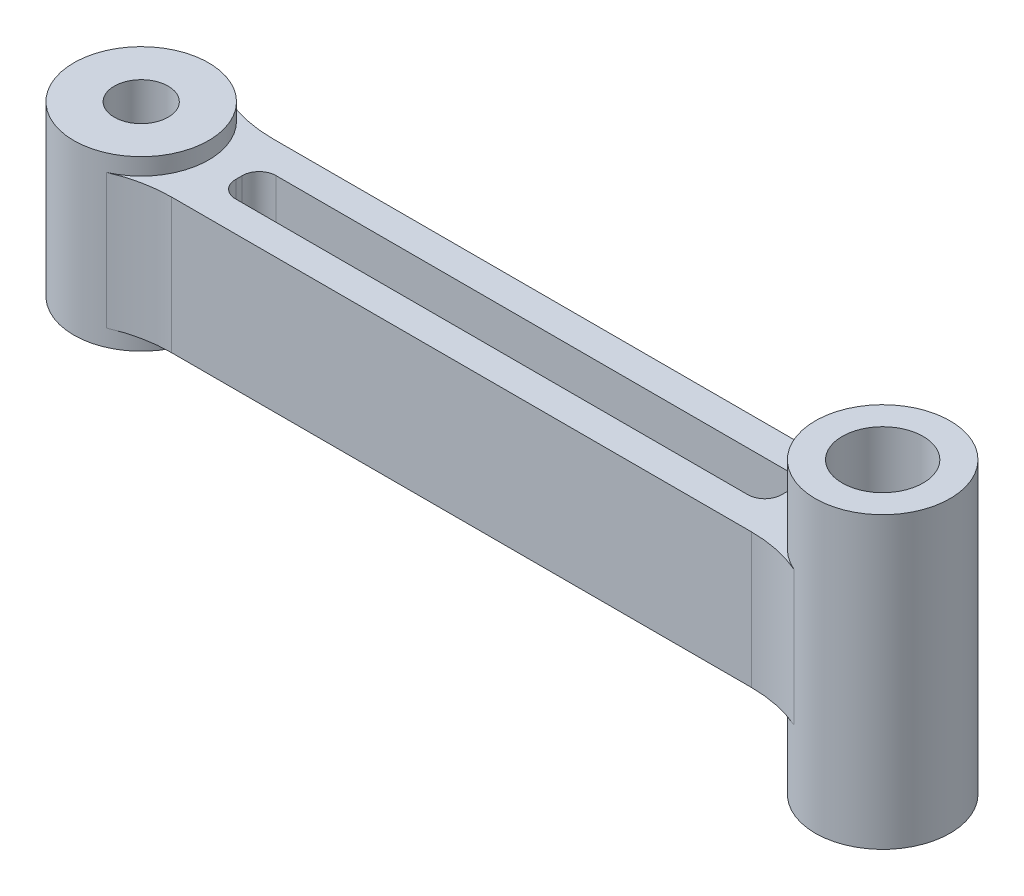
ISO-10303-21;
HEADER;
FILE_DESCRIPTION(('STEP AP214'),'2;1');
FILE_NAME('part.step','',(''),(''),'','','');
FILE_SCHEMA(('AUTOMOTIVE_DESIGN { 1 0 10303 214 1 1 1 1 }'));
ENDSEC;
DATA;
#1=APPLICATION_CONTEXT('core data for automotive mechanical design processes');
#2=APPLICATION_PROTOCOL_DEFINITION('international standard','automotive_design',2000,#1);
#3=PRODUCT_CONTEXT('',#1,'mechanical');
#4=PRODUCT('Part','Part','',(#3));
#5=PRODUCT_RELATED_PRODUCT_CATEGORY('part','',(#4));
#6=PRODUCT_DEFINITION_FORMATION('','',#4);
#7=PRODUCT_DEFINITION_CONTEXT('part definition',#1,'design');
#8=PRODUCT_DEFINITION('design','',#6,#7);
#9=PRODUCT_DEFINITION_SHAPE('','',#8);
#10=(LENGTH_UNIT() NAMED_UNIT(*) SI_UNIT(.MILLI.,.METRE.));
#11=(NAMED_UNIT(*) PLANE_ANGLE_UNIT() SI_UNIT($,.RADIAN.));
#12=(NAMED_UNIT(*) SI_UNIT($,.STERADIAN.) SOLID_ANGLE_UNIT());
#13=UNCERTAINTY_MEASURE_WITH_UNIT(LENGTH_MEASURE(1.E-05),#10,'distance_accuracy_value','');
#14=(GEOMETRIC_REPRESENTATION_CONTEXT(3) GLOBAL_UNCERTAINTY_ASSIGNED_CONTEXT((#13)) GLOBAL_UNIT_ASSIGNED_CONTEXT((#10,
#11,#12)) REPRESENTATION_CONTEXT('',''));
#15=CARTESIAN_POINT('',(0.,0.,0.));
#16=DIRECTION('',(0.,0.,1.));
#17=DIRECTION('',(1.,0.,0.));
#18=AXIS2_PLACEMENT_3D('',#15,#16,#17);
#19=CARTESIAN_POINT('',(0.,-10.,0.));
#20=DIRECTION('',(0.,1.,0.));
#21=DIRECTION('',(0.,0.,1.));
#22=AXIS2_PLACEMENT_3D('',#19,#20,#21);
#23=PLANE('',#22);
#24=DIRECTION('',(-1.,0.,0.));
#25=VECTOR('',#24,1.);
#26=CARTESIAN_POINT('',(0.,-10.,-15.));
#27=LINE('',#26,#25);
#28=CARTESIAN_POINT('',(43.0104211917182,-10.,-15.));
#29=VERTEX_POINT('',#28);
#30=CARTESIAN_POINT('',(-43.0104211917182,-10.,-15.));
#31=VERTEX_POINT('',#30);
#32=EDGE_CURVE('E216',#29,#31,#27,.T.);
#33=ORIENTED_EDGE('',*,*,#32,.F.);
#34=CARTESIAN_POINT('',(43.0104211917182,-10.,-35.));
#35=DIRECTION('',(0.,1.,0.));
#36=DIRECTION('',(0.,0.,1.));
#37=AXIS2_PLACEMENT_3D('',#34,#35,#36);
#38=CIRCLE('',#37,20.);
#39=CARTESIAN_POINT('',(51.0034737305728,-10.,-16.6666666666667));
#40=VERTEX_POINT('',#39);
#41=EDGE_CURVE('E200',#29,#40,#38,.T.);
#42=ORIENTED_EDGE('',*,*,#41,.T.);
#43=CARTESIAN_POINT('',(55.,-10.,-7.49999999999999));
#44=DIRECTION('',(0.,-1.,0.));
#45=DIRECTION('',(0.,0.,1.));
#46=AXIS2_PLACEMENT_3D('',#43,#44,#45);
#47=CIRCLE('',#46,9.99999999999999);
#48=CARTESIAN_POINT('',(51.0034737305727,-10.,1.66666666666667));
#49=VERTEX_POINT('',#48);
#50=EDGE_CURVE('E458',#49,#40,#47,.T.);
#51=ORIENTED_EDGE('',*,*,#50,.F.);
#52=CARTESIAN_POINT('',(43.0104211917182,-10.,20.));
#53=DIRECTION('',(0.,1.,0.));
#54=DIRECTION('',(0.,0.,1.));
#55=AXIS2_PLACEMENT_3D('',#52,#53,#54);
#56=CIRCLE('',#55,20.);
#57=CARTESIAN_POINT('',(43.0104211917182,-10.,0.));
#58=VERTEX_POINT('',#57);
#59=EDGE_CURVE('E256',#49,#58,#56,.T.);
#60=ORIENTED_EDGE('',*,*,#59,.T.);
#61=DIRECTION('',(-1.,0.,0.));
#62=VECTOR('',#61,1.);
#63=CARTESIAN_POINT('',(0.,-10.,0.));
#64=LINE('',#63,#62);
#65=CARTESIAN_POINT('',(-43.0104211917182,-10.,0.));
#66=VERTEX_POINT('',#65);
#67=EDGE_CURVE('E229',#58,#66,#64,.T.);
#68=ORIENTED_EDGE('',*,*,#67,.T.);
#69=CARTESIAN_POINT('',(-43.0104211917182,-10.,20.));
#70=DIRECTION('',(0.,1.,0.));
#71=DIRECTION('',(0.,0.,1.));
#72=AXIS2_PLACEMENT_3D('',#69,#70,#71);
#73=CIRCLE('',#72,20.);
#74=CARTESIAN_POINT('',(-51.0034737305727,-10.,1.66666666666667));
#75=VERTEX_POINT('',#74);
#76=EDGE_CURVE('E265',#66,#75,#73,.T.);
#77=ORIENTED_EDGE('',*,*,#76,.T.);
#78=CARTESIAN_POINT('',(-55.,-10.,-7.49999999999999));
#79=DIRECTION('',(0.,1.,0.));
#80=DIRECTION('',(0.,0.,1.));
#81=AXIS2_PLACEMENT_3D('',#78,#79,#80);
#82=CIRCLE('',#81,9.99999999999999);
#83=CARTESIAN_POINT('',(-51.0034737305727,-10.,-16.6666666666667));
#84=VERTEX_POINT('',#83);
#85=EDGE_CURVE('E226',#75,#84,#82,.T.);
#86=ORIENTED_EDGE('',*,*,#85,.T.);
#87=CARTESIAN_POINT('',(-43.0104211917182,-10.,-35.));
#88=DIRECTION('',(0.,1.,0.));
#89=DIRECTION('',(0.,0.,1.));
#90=AXIS2_PLACEMENT_3D('',#87,#88,#89);
#91=CIRCLE('',#90,20.);
#92=EDGE_CURVE('E225',#84,#31,#91,.T.);
#93=ORIENTED_EDGE('',*,*,#92,.T.);
#94=EDGE_LOOP('',(#33,#42,#51,#60,#68,#77,#86,#93));
#95=FACE_BOUND('',#94,.T.);
#96=DIRECTION('',(-1.,0.,0.));
#97=VECTOR('',#96,1.);
#98=CARTESIAN_POINT('',(40.8137390408889,-10.,-10.5));
#99=LINE('',#98,#97);
#100=CARTESIAN_POINT('',(38.0073545320336,-10.,-10.5));
#101=VERTEX_POINT('',#100);
#102=CARTESIAN_POINT('',(-38.0073545320336,-10.,-10.5));
#103=VERTEX_POINT('',#102);
#104=EDGE_CURVE('E598',#101,#103,#99,.T.);
#105=ORIENTED_EDGE('',*,*,#104,.T.);
#106=CARTESIAN_POINT('',(-38.0073545320336,-10.,-8.));
#107=DIRECTION('',(0.,1.,0.));
#108=DIRECTION('',(0.,0.,1.));
#109=AXIS2_PLACEMENT_3D('',#106,#107,#108);
#110=CIRCLE('',#109,2.5);
#111=CARTESIAN_POINT('',(-40.5062729832051,-10.,-7.92647058823529));
#112=VERTEX_POINT('',#111);
#113=EDGE_CURVE('E327',#103,#112,#110,.T.);
#114=ORIENTED_EDGE('',*,*,#113,.T.);
#115=CARTESIAN_POINT('',(-55.,-10.,-7.49999999999999));
#116=DIRECTION('',(0.,-1.,0.));
#117=DIRECTION('',(0.,0.,1.));
#118=AXIS2_PLACEMENT_3D('',#115,#116,#117);
#119=CIRCLE('',#118,14.5);
#120=CARTESIAN_POINT('',(-40.5062729832051,-10.,-7.0735294117647));
#121=VERTEX_POINT('',#120);
#122=EDGE_CURVE('E592',#112,#121,#119,.T.);
#123=ORIENTED_EDGE('',*,*,#122,.T.);
#124=CARTESIAN_POINT('',(-38.0073545320336,-10.,-6.99999999999999));
#125=DIRECTION('',(0.,1.,0.));
#126=DIRECTION('',(0.,0.,1.));
#127=AXIS2_PLACEMENT_3D('',#124,#125,#126);
#128=CIRCLE('',#127,2.5);
#129=CARTESIAN_POINT('',(-38.0073545320336,-10.,-4.49999999999999));
#130=VERTEX_POINT('',#129);
#131=EDGE_CURVE('E325',#121,#130,#128,.T.);
#132=ORIENTED_EDGE('',*,*,#131,.T.);
#133=DIRECTION('',(1.,0.,0.));
#134=VECTOR('',#133,1.);
#135=CARTESIAN_POINT('',(40.8137390408889,-10.,-4.49999999999999));
#136=LINE('',#135,#134);
#137=CARTESIAN_POINT('',(38.0073545320336,-10.,-4.49999999999999));
#138=VERTEX_POINT('',#137);
#139=EDGE_CURVE('E453',#130,#138,#136,.T.);
#140=ORIENTED_EDGE('',*,*,#139,.T.);
#141=CARTESIAN_POINT('',(38.0073545320336,-10.,-6.99999999999999));
#142=DIRECTION('',(0.,1.,0.));
#143=DIRECTION('',(0.,0.,1.));
#144=AXIS2_PLACEMENT_3D('',#141,#142,#143);
#145=CIRCLE('',#144,2.5);
#146=CARTESIAN_POINT('',(40.5062729832051,-10.,-7.0735294117647));
#147=VERTEX_POINT('',#146);
#148=EDGE_CURVE('E329',#138,#147,#145,.T.);
#149=ORIENTED_EDGE('',*,*,#148,.T.);
#150=CARTESIAN_POINT('',(55.,-10.,-7.49999999999999));
#151=DIRECTION('',(0.,-1.,0.));
#152=DIRECTION('',(0.,0.,1.));
#153=AXIS2_PLACEMENT_3D('',#150,#151,#152);
#154=CIRCLE('',#153,14.5);
#155=CARTESIAN_POINT('',(40.5062729832051,-10.,-7.92647058823529));
#156=VERTEX_POINT('',#155);
#157=EDGE_CURVE('E600',#147,#156,#154,.T.);
#158=ORIENTED_EDGE('',*,*,#157,.T.);
#159=CARTESIAN_POINT('',(38.0073545320336,-10.,-7.99999999999999));
#160=DIRECTION('',(0.,1.,0.));
#161=DIRECTION('',(0.,0.,1.));
#162=AXIS2_PLACEMENT_3D('',#159,#160,#161);
#163=CIRCLE('',#162,2.5);
#164=EDGE_CURVE('E331',#156,#101,#163,.T.);
#165=ORIENTED_EDGE('',*,*,#164,.T.);
#166=EDGE_LOOP('',(#105,#114,#123,#132,#140,#149,#158,#165));
#167=FACE_BOUND('',#166,.T.);
#168=ADVANCED_FACE('F37',(#95,#167),#23,.F.);
#169=CARTESIAN_POINT('',(-55.,21.5,-7.49999999999999));
#170=DIRECTION('',(0.,-1.,0.));
#171=DIRECTION('',(0.,0.,-1.));
#172=AXIS2_PLACEMENT_3D('',#169,#170,#171);
#173=CYLINDRICAL_SURFACE('',#172,4.00000000000001);
#174=CARTESIAN_POINT('',(-55.,12.5,-7.49999999999999));
#175=DIRECTION('',(0.,1.,0.));
#176=DIRECTION('',(0.,0.,1.));
#177=AXIS2_PLACEMENT_3D('',#174,#175,#176);
#178=CIRCLE('',#177,4.00000000000001);
#179=CARTESIAN_POINT('',(-55.,12.5,-3.49999999999998));
#180=VERTEX_POINT('',#179);
#181=EDGE_CURVE('E340',#180,#180,#178,.T.);
#182=ORIENTED_EDGE('',*,*,#181,.T.);
#183=EDGE_LOOP('',(#182));
#184=FACE_BOUND('',#183,.T.);
#185=CARTESIAN_POINT('',(-55.,-12.5,-7.49999999999999));
#186=DIRECTION('',(0.,1.,0.));
#187=DIRECTION('',(0.,0.,1.));
#188=AXIS2_PLACEMENT_3D('',#185,#186,#187);
#189=CIRCLE('',#188,4.00000000000001);
#190=CARTESIAN_POINT('',(-55.,-12.5,-3.49999999999998));
#191=VERTEX_POINT('',#190);
#192=EDGE_CURVE('E41',#191,#191,#189,.T.);
#193=ORIENTED_EDGE('',*,*,#192,.F.);
#194=EDGE_LOOP('',(#193));
#195=FACE_BOUND('',#194,.T.);
#196=ADVANCED_FACE('F39',(#184,#195),#173,.F.);
#197=CARTESIAN_POINT('',(-55.,21.5,-7.49999999999999));
#198=DIRECTION('',(0.,-1.,0.));
#199=DIRECTION('',(0.,0.,-1.));
#200=AXIS2_PLACEMENT_3D('',#197,#198,#199);
#201=CYLINDRICAL_SURFACE('',#200,9.99999999999999);
#202=DIRECTION('',(0.,-1.,0.));
#203=VECTOR('',#202,1.);
#204=CARTESIAN_POINT('',(-51.0034737305727,21.5,-16.6666666666667));
#205=LINE('',#204,#203);
#206=CARTESIAN_POINT('',(-51.0034737305727,10.,-16.6666666666667));
#207=VERTEX_POINT('',#206);
#208=EDGE_CURVE('E210',#207,#84,#205,.T.);
#209=ORIENTED_EDGE('',*,*,#208,.T.);
#210=ORIENTED_EDGE('',*,*,#85,.F.);
#211=DIRECTION('',(0.,-1.,0.));
#212=VECTOR('',#211,1.);
#213=CARTESIAN_POINT('',(-51.0034737305727,21.5,1.66666666666667));
#214=LINE('',#213,#212);
#215=CARTESIAN_POINT('',(-51.0034737305727,10.,1.66666666666667));
#216=VERTEX_POINT('',#215);
#217=EDGE_CURVE('E250',#75,#216,#214,.F.);
#218=ORIENTED_EDGE('',*,*,#217,.T.);
#219=CARTESIAN_POINT('',(-55.,10.,-7.49999999999999));
#220=DIRECTION('',(0.,1.,0.));
#221=DIRECTION('',(0.,0.,1.));
#222=AXIS2_PLACEMENT_3D('',#219,#220,#221);
#223=CIRCLE('',#222,9.99999999999999);
#224=EDGE_CURVE('E478',#216,#207,#223,.T.);
#225=ORIENTED_EDGE('',*,*,#224,.T.);
#226=EDGE_LOOP('',(#209,#210,#218,#225));
#227=FACE_BOUND('',#226,.T.);
#228=CARTESIAN_POINT('',(-55.,12.5,-7.49999999999999));
#229=DIRECTION('',(0.,1.,0.));
#230=DIRECTION('',(0.,0.,1.));
#231=AXIS2_PLACEMENT_3D('',#228,#229,#230);
#232=CIRCLE('',#231,9.99999999999999);
#233=CARTESIAN_POINT('',(-55.,12.5,2.5));
#234=VERTEX_POINT('',#233);
#235=EDGE_CURVE('E240',#234,#234,#232,.T.);
#236=ORIENTED_EDGE('',*,*,#235,.F.);
#237=EDGE_LOOP('',(#236));
#238=FACE_BOUND('',#237,.T.);
#239=CARTESIAN_POINT('',(-55.,-12.5,-7.49999999999999));
#240=DIRECTION('',(0.,1.,0.));
#241=DIRECTION('',(0.,0.,1.));
#242=AXIS2_PLACEMENT_3D('',#239,#240,#241);
#243=CIRCLE('',#242,9.99999999999999);
#244=CARTESIAN_POINT('',(-55.,-12.5,2.5));
#245=VERTEX_POINT('',#244);
#246=EDGE_CURVE('E341',#245,#245,#243,.T.);
#247=ORIENTED_EDGE('',*,*,#246,.T.);
#248=EDGE_LOOP('',(#247));
#249=FACE_BOUND('',#248,.T.);
#250=ADVANCED_FACE('F352',(#227,#238,#249),#201,.T.);
#251=CARTESIAN_POINT('',(0.,12.5,0.));
#252=DIRECTION('',(0.,1.,0.));
#253=DIRECTION('',(0.,0.,1.));
#254=AXIS2_PLACEMENT_3D('',#251,#252,#253);
#255=PLANE('',#254);
#256=ORIENTED_EDGE('',*,*,#181,.F.);
#257=EDGE_LOOP('',(#256));
#258=FACE_BOUND('',#257,.T.);
#259=ORIENTED_EDGE('',*,*,#235,.T.);
#260=EDGE_LOOP('',(#259));
#261=FACE_BOUND('',#260,.T.);
#262=ADVANCED_FACE('F348',(#258,#261),#255,.T.);
#263=CARTESIAN_POINT('',(0.,-12.5,0.));
#264=DIRECTION('',(0.,1.,0.));
#265=DIRECTION('',(0.,0.,1.));
#266=AXIS2_PLACEMENT_3D('',#263,#264,#265);
#267=PLANE('',#266);
#268=ORIENTED_EDGE('',*,*,#192,.T.);
#269=EDGE_LOOP('',(#268));
#270=FACE_BOUND('',#269,.T.);
#271=ORIENTED_EDGE('',*,*,#246,.F.);
#272=EDGE_LOOP('',(#271));
#273=FACE_BOUND('',#272,.T.);
#274=ADVANCED_FACE('F351',(#270,#273),#267,.F.);
#275=CARTESIAN_POINT('',(0.,10.,-15.));
#276=DIRECTION('',(0.,0.,1.));
#277=DIRECTION('',(1.,0.,0.));
#278=AXIS2_PLACEMENT_3D('',#275,#276,#277);
#279=PLANE('',#278);
#280=DIRECTION('',(-1.,0.,0.));
#281=VECTOR('',#280,1.);
#282=CARTESIAN_POINT('',(0.,10.,-15.));
#283=LINE('',#282,#281);
#284=CARTESIAN_POINT('',(43.0104211917182,10.,-15.));
#285=VERTEX_POINT('',#284);
#286=CARTESIAN_POINT('',(-43.0104211917182,10.,-15.));
#287=VERTEX_POINT('',#286);
#288=EDGE_CURVE('E219',#285,#287,#283,.T.);
#289=ORIENTED_EDGE('',*,*,#288,.F.);
#290=DIRECTION('',(0.,1.,0.));
#291=VECTOR('',#290,1.);
#292=CARTESIAN_POINT('',(43.0104211917182,-10.,-15.));
#293=LINE('',#292,#291);
#294=EDGE_CURVE('E204',#285,#29,#293,.F.);
#295=ORIENTED_EDGE('',*,*,#294,.T.);
#296=ORIENTED_EDGE('',*,*,#32,.T.);
#297=DIRECTION('',(0.,1.,0.));
#298=VECTOR('',#297,1.);
#299=CARTESIAN_POINT('',(-43.0104211917182,10.,-15.));
#300=LINE('',#299,#298);
#301=EDGE_CURVE('E221',#31,#287,#300,.T.);
#302=ORIENTED_EDGE('',*,*,#301,.T.);
#303=EDGE_LOOP('',(#289,#295,#296,#302));
#304=FACE_BOUND('',#303,.T.);
#305=ADVANCED_FACE('F215',(#304),#279,.F.);
#306=CARTESIAN_POINT('',(0.,10.,0.));
#307=DIRECTION('',(0.,0.,1.));
#308=DIRECTION('',(1.,0.,0.));
#309=AXIS2_PLACEMENT_3D('',#306,#307,#308);
#310=PLANE('',#309);
#311=ORIENTED_EDGE('',*,*,#67,.F.);
#312=DIRECTION('',(0.,-1.,0.));
#313=VECTOR('',#312,1.);
#314=CARTESIAN_POINT('',(43.0104211917182,10.,0.));
#315=LINE('',#314,#313);
#316=CARTESIAN_POINT('',(43.0104211917182,10.,0.));
#317=VERTEX_POINT('',#316);
#318=EDGE_CURVE('E248',#58,#317,#315,.F.);
#319=ORIENTED_EDGE('',*,*,#318,.T.);
#320=DIRECTION('',(-1.,0.,0.));
#321=VECTOR('',#320,1.);
#322=CARTESIAN_POINT('',(0.,10.,0.));
#323=LINE('',#322,#321);
#324=CARTESIAN_POINT('',(-43.0104211917182,10.,0.));
#325=VERTEX_POINT('',#324);
#326=EDGE_CURVE('E235',#317,#325,#323,.T.);
#327=ORIENTED_EDGE('',*,*,#326,.T.);
#328=DIRECTION('',(0.,-1.,0.));
#329=VECTOR('',#328,1.);
#330=CARTESIAN_POINT('',(-43.0104211917182,10.,0.));
#331=LINE('',#330,#329);
#332=EDGE_CURVE('E245',#325,#66,#331,.T.);
#333=ORIENTED_EDGE('',*,*,#332,.T.);
#334=EDGE_LOOP('',(#311,#319,#327,#333));
#335=FACE_BOUND('',#334,.T.);
#336=ADVANCED_FACE('F367',(#335),#310,.T.);
#337=CARTESIAN_POINT('',(0.,10.,0.));
#338=DIRECTION('',(0.,1.,0.));
#339=DIRECTION('',(0.,0.,1.));
#340=AXIS2_PLACEMENT_3D('',#337,#338,#339);
#341=PLANE('',#340);
#342=CARTESIAN_POINT('',(-55.,10.,-7.49999999999999));
#343=DIRECTION('',(0.,-1.,0.));
#344=DIRECTION('',(0.,0.,1.));
#345=AXIS2_PLACEMENT_3D('',#342,#343,#344);
#346=CIRCLE('',#345,14.5);
#347=CARTESIAN_POINT('',(-40.5062729832051,10.,-7.92647058823529));
#348=VERTEX_POINT('',#347);
#349=CARTESIAN_POINT('',(-40.5062729832051,10.,-7.0735294117647));
#350=VERTEX_POINT('',#349);
#351=EDGE_CURVE('E459',#348,#350,#346,.T.);
#352=ORIENTED_EDGE('',*,*,#351,.F.);
#353=CARTESIAN_POINT('',(-38.0073545320336,10.,-8.));
#354=DIRECTION('',(0.,1.,0.));
#355=DIRECTION('',(0.,0.,1.));
#356=AXIS2_PLACEMENT_3D('',#353,#354,#355);
#357=CIRCLE('',#356,2.5);
#358=CARTESIAN_POINT('',(-38.0073545320336,10.,-10.5));
#359=VERTEX_POINT('',#358);
#360=EDGE_CURVE('E12',#348,#359,#357,.F.);
#361=ORIENTED_EDGE('',*,*,#360,.T.);
#362=DIRECTION('',(-1.,0.,0.));
#363=VECTOR('',#362,1.);
#364=CARTESIAN_POINT('',(40.8137390408889,10.,-10.5));
#365=LINE('',#364,#363);
#366=CARTESIAN_POINT('',(38.0073545320336,10.,-10.5));
#367=VERTEX_POINT('',#366);
#368=EDGE_CURVE('E444',#367,#359,#365,.T.);
#369=ORIENTED_EDGE('',*,*,#368,.F.);
#370=CARTESIAN_POINT('',(38.0073545320336,10.,-7.99999999999999));
#371=DIRECTION('',(0.,1.,0.));
#372=DIRECTION('',(0.,0.,1.));
#373=AXIS2_PLACEMENT_3D('',#370,#371,#372);
#374=CIRCLE('',#373,2.5);
#375=CARTESIAN_POINT('',(40.5062729832051,10.,-7.92647058823529));
#376=VERTEX_POINT('',#375);
#377=EDGE_CURVE('E333',#367,#376,#374,.F.);
#378=ORIENTED_EDGE('',*,*,#377,.T.);
#379=CARTESIAN_POINT('',(55.,10.,-7.49999999999999));
#380=DIRECTION('',(0.,-1.,0.));
#381=DIRECTION('',(0.,0.,1.));
#382=AXIS2_PLACEMENT_3D('',#379,#380,#381);
#383=CIRCLE('',#382,14.5);
#384=CARTESIAN_POINT('',(40.5062729832051,10.,-7.0735294117647));
#385=VERTEX_POINT('',#384);
#386=EDGE_CURVE('E450',#385,#376,#383,.T.);
#387=ORIENTED_EDGE('',*,*,#386,.F.);
#388=CARTESIAN_POINT('',(38.0073545320336,10.,-6.99999999999999));
#389=DIRECTION('',(0.,1.,0.));
#390=DIRECTION('',(0.,0.,1.));
#391=AXIS2_PLACEMENT_3D('',#388,#389,#390);
#392=CIRCLE('',#391,2.5);
#393=CARTESIAN_POINT('',(38.0073545320336,10.,-4.49999999999999));
#394=VERTEX_POINT('',#393);
#395=EDGE_CURVE('E335',#385,#394,#392,.F.);
#396=ORIENTED_EDGE('',*,*,#395,.T.);
#397=DIRECTION('',(1.,0.,0.));
#398=VECTOR('',#397,1.);
#399=CARTESIAN_POINT('',(40.8137390408889,10.,-4.49999999999999));
#400=LINE('',#399,#398);
#401=CARTESIAN_POINT('',(-38.0073545320336,10.,-4.49999999999999));
#402=VERTEX_POINT('',#401);
#403=EDGE_CURVE('E461',#402,#394,#400,.T.);
#404=ORIENTED_EDGE('',*,*,#403,.F.);
#405=CARTESIAN_POINT('',(-38.0073545320336,10.,-6.99999999999999));
#406=DIRECTION('',(0.,1.,0.));
#407=DIRECTION('',(0.,0.,1.));
#408=AXIS2_PLACEMENT_3D('',#405,#406,#407);
#409=CIRCLE('',#408,2.5);
#410=EDGE_CURVE('E46',#402,#350,#409,.F.);
#411=ORIENTED_EDGE('',*,*,#410,.T.);
#412=EDGE_LOOP('',(#352,#361,#369,#378,#387,#396,#404,#411));
#413=FACE_BOUND('',#412,.T.);
#414=ORIENTED_EDGE('',*,*,#326,.F.);
#415=CARTESIAN_POINT('',(43.0104211917182,10.,20.));
#416=DIRECTION('',(0.,1.,0.));
#417=DIRECTION('',(0.,0.,1.));
#418=AXIS2_PLACEMENT_3D('',#415,#416,#417);
#419=CIRCLE('',#418,20.);
#420=CARTESIAN_POINT('',(51.0034737305727,10.,1.66666666666667));
#421=VERTEX_POINT('',#420);
#422=EDGE_CURVE('E258',#317,#421,#419,.F.);
#423=ORIENTED_EDGE('',*,*,#422,.T.);
#424=CARTESIAN_POINT('',(55.,10.,-7.49999999999999));
#425=DIRECTION('',(0.,-1.,0.));
#426=DIRECTION('',(0.,0.,1.));
#427=AXIS2_PLACEMENT_3D('',#424,#425,#426);
#428=CIRCLE('',#427,9.99999999999999);
#429=CARTESIAN_POINT('',(51.0034737305728,10.,-16.6666666666667));
#430=VERTEX_POINT('',#429);
#431=EDGE_CURVE('E467',#421,#430,#428,.T.);
#432=ORIENTED_EDGE('',*,*,#431,.T.);
#433=CARTESIAN_POINT('',(43.0104211917182,10.,-35.));
#434=DIRECTION('',(0.,1.,0.));
#435=DIRECTION('',(0.,0.,1.));
#436=AXIS2_PLACEMENT_3D('',#433,#434,#435);
#437=CIRCLE('',#436,20.);
#438=EDGE_CURVE('E209',#430,#285,#437,.F.);
#439=ORIENTED_EDGE('',*,*,#438,.T.);
#440=ORIENTED_EDGE('',*,*,#288,.T.);
#441=CARTESIAN_POINT('',(-43.0104211917182,10.,-35.));
#442=DIRECTION('',(0.,1.,0.));
#443=DIRECTION('',(0.,0.,1.));
#444=AXIS2_PLACEMENT_3D('',#441,#442,#443);
#445=CIRCLE('',#444,20.);
#446=EDGE_CURVE('E262',#287,#207,#445,.F.);
#447=ORIENTED_EDGE('',*,*,#446,.T.);
#448=ORIENTED_EDGE('',*,*,#224,.F.);
#449=CARTESIAN_POINT('',(-43.0104211917182,10.,20.));
#450=DIRECTION('',(0.,1.,0.));
#451=DIRECTION('',(0.,0.,1.));
#452=AXIS2_PLACEMENT_3D('',#449,#450,#451);
#453=CIRCLE('',#452,20.);
#454=EDGE_CURVE('E268',#216,#325,#453,.F.);
#455=ORIENTED_EDGE('',*,*,#454,.T.);
#456=EDGE_LOOP('',(#414,#423,#432,#439,#440,#447,#448,#455));
#457=FACE_BOUND('',#456,.T.);
#458=ADVANCED_FACE('F377',(#413,#457),#341,.T.);
#459=CARTESIAN_POINT('',(55.,21.5,-7.49999999999999));
#460=DIRECTION('',(0.,-1.,0.));
#461=DIRECTION('',(0.,0.,-1.));
#462=AXIS2_PLACEMENT_3D('',#459,#460,#461);
#463=CYLINDRICAL_SURFACE('',#462,6.00000000000001);
#464=CARTESIAN_POINT('',(55.,21.5,-7.49999999999999));
#465=DIRECTION('',(0.,-1.,0.));
#466=DIRECTION('',(0.,0.,1.));
#467=AXIS2_PLACEMENT_3D('',#464,#465,#466);
#468=CIRCLE('',#467,6.00000000000001);
#469=CARTESIAN_POINT('',(55.,21.5,-1.49999999999998));
#470=VERTEX_POINT('',#469);
#471=EDGE_CURVE('E232',#470,#470,#468,.T.);
#472=ORIENTED_EDGE('',*,*,#471,.F.);
#473=EDGE_LOOP('',(#472));
#474=FACE_BOUND('',#473,.T.);
#475=CARTESIAN_POINT('',(55.,-21.5,-7.49999999999999));
#476=DIRECTION('',(0.,-1.,0.));
#477=DIRECTION('',(0.,0.,1.));
#478=AXIS2_PLACEMENT_3D('',#475,#476,#477);
#479=CIRCLE('',#478,6.00000000000001);
#480=CARTESIAN_POINT('',(55.,-21.5,-1.49999999999998));
#481=VERTEX_POINT('',#480);
#482=EDGE_CURVE('E469',#481,#481,#479,.T.);
#483=ORIENTED_EDGE('',*,*,#482,.T.);
#484=EDGE_LOOP('',(#483));
#485=FACE_BOUND('',#484,.T.);
#486=ADVANCED_FACE('F496',(#474,#485),#463,.F.);
#487=CARTESIAN_POINT('',(55.,21.5,-7.49999999999999));
#488=DIRECTION('',(0.,-1.,0.));
#489=DIRECTION('',(0.,0.,-1.));
#490=AXIS2_PLACEMENT_3D('',#487,#488,#489);
#491=CYLINDRICAL_SURFACE('',#490,9.99999999999999);
#492=ORIENTED_EDGE('',*,*,#50,.T.);
#493=DIRECTION('',(0.,-1.,0.));
#494=VECTOR('',#493,1.);
#495=CARTESIAN_POINT('',(51.0034737305728,21.5,-16.6666666666667));
#496=LINE('',#495,#494);
#497=EDGE_CURVE('E206',#40,#430,#496,.F.);
#498=ORIENTED_EDGE('',*,*,#497,.T.);
#499=ORIENTED_EDGE('',*,*,#431,.F.);
#500=DIRECTION('',(0.,-1.,0.));
#501=VECTOR('',#500,1.);
#502=CARTESIAN_POINT('',(51.0034737305727,21.5,1.66666666666667));
#503=LINE('',#502,#501);
#504=EDGE_CURVE('E220',#421,#49,#503,.T.);
#505=ORIENTED_EDGE('',*,*,#504,.T.);
#506=EDGE_LOOP('',(#492,#498,#499,#505));
#507=FACE_BOUND('',#506,.T.);
#508=CARTESIAN_POINT('',(55.,21.5,-7.49999999999999));
#509=DIRECTION('',(0.,-1.,0.));
#510=DIRECTION('',(0.,0.,1.));
#511=AXIS2_PLACEMENT_3D('',#508,#509,#510);
#512=CIRCLE('',#511,9.99999999999999);
#513=CARTESIAN_POINT('',(55.,21.5,2.5));
#514=VERTEX_POINT('',#513);
#515=EDGE_CURVE('E227',#514,#514,#512,.T.);
#516=ORIENTED_EDGE('',*,*,#515,.T.);
#517=EDGE_LOOP('',(#516));
#518=FACE_BOUND('',#517,.T.);
#519=CARTESIAN_POINT('',(55.,-21.5,-7.49999999999999));
#520=DIRECTION('',(0.,-1.,0.));
#521=DIRECTION('',(0.,0.,1.));
#522=AXIS2_PLACEMENT_3D('',#519,#520,#521);
#523=CIRCLE('',#522,9.99999999999999);
#524=CARTESIAN_POINT('',(55.,-21.5,2.5));
#525=VERTEX_POINT('',#524);
#526=EDGE_CURVE('E472',#525,#525,#523,.T.);
#527=ORIENTED_EDGE('',*,*,#526,.F.);
#528=EDGE_LOOP('',(#527));
#529=FACE_BOUND('',#528,.T.);
#530=ADVANCED_FACE('F492',(#507,#518,#529),#491,.T.);
#531=CARTESIAN_POINT('',(0.,21.5,0.));
#532=DIRECTION('',(0.,1.,0.));
#533=DIRECTION('',(0.,0.,1.));
#534=AXIS2_PLACEMENT_3D('',#531,#532,#533);
#535=PLANE('',#534);
#536=ORIENTED_EDGE('',*,*,#471,.T.);
#537=EDGE_LOOP('',(#536));
#538=FACE_BOUND('',#537,.T.);
#539=ORIENTED_EDGE('',*,*,#515,.F.);
#540=EDGE_LOOP('',(#539));
#541=FACE_BOUND('',#540,.T.);
#542=ADVANCED_FACE('F495',(#538,#541),#535,.T.);
#543=CARTESIAN_POINT('',(0.,-21.5,0.));
#544=DIRECTION('',(0.,1.,0.));
#545=DIRECTION('',(0.,0.,1.));
#546=AXIS2_PLACEMENT_3D('',#543,#544,#545);
#547=PLANE('',#546);
#548=ORIENTED_EDGE('',*,*,#482,.F.);
#549=EDGE_LOOP('',(#548));
#550=FACE_BOUND('',#549,.T.);
#551=ORIENTED_EDGE('',*,*,#526,.T.);
#552=EDGE_LOOP('',(#551));
#553=FACE_BOUND('',#552,.T.);
#554=ADVANCED_FACE('F502',(#550,#553),#547,.F.);
#555=CARTESIAN_POINT('',(-55.,3.75,-7.49999999999999));
#556=DIRECTION('',(0.,1.,0.));
#557=DIRECTION('',(0.,0.,1.));
#558=AXIS2_PLACEMENT_3D('',#555,#556,#557);
#559=CYLINDRICAL_SURFACE('',#558,14.5);
#560=ORIENTED_EDGE('',*,*,#351,.T.);
#561=DIRECTION('',(0.,1.,0.));
#562=VECTOR('',#561,1.);
#563=CARTESIAN_POINT('',(-40.5062729832051,3.75,-7.0735294117647));
#564=LINE('',#563,#562);
#565=CARTESIAN_POINT('',(-40.5062729832051,3.75,-7.0735294117647));
#566=VERTEX_POINT('',#565);
#567=EDGE_CURVE('E323',#350,#566,#564,.F.);
#568=ORIENTED_EDGE('',*,*,#567,.T.);
#569=CARTESIAN_POINT('',(-55.,3.75,-7.49999999999999));
#570=DIRECTION('',(0.,-1.,0.));
#571=DIRECTION('',(0.,0.,1.));
#572=AXIS2_PLACEMENT_3D('',#569,#570,#571);
#573=CIRCLE('',#572,14.5);
#574=CARTESIAN_POINT('',(-40.5062729832051,3.75,-7.92647058823529));
#575=VERTEX_POINT('',#574);
#576=EDGE_CURVE('E436',#575,#566,#573,.T.);
#577=ORIENTED_EDGE('',*,*,#576,.F.);
#578=DIRECTION('',(0.,1.,0.));
#579=VECTOR('',#578,1.);
#580=CARTESIAN_POINT('',(-40.5062729832051,3.75,-7.92647058823529));
#581=LINE('',#580,#579);
#582=EDGE_CURVE('E321',#575,#348,#581,.T.);
#583=ORIENTED_EDGE('',*,*,#582,.T.);
#584=EDGE_LOOP('',(#560,#568,#577,#583));
#585=FACE_BOUND('',#584,.T.);
#586=ADVANCED_FACE('F441',(#585),#559,.T.);
#587=CARTESIAN_POINT('',(40.8137390408889,3.75,-10.5));
#588=DIRECTION('',(0.,0.,-1.));
#589=DIRECTION('',(-1.,0.,0.));
#590=AXIS2_PLACEMENT_3D('',#587,#588,#589);
#591=PLANE('',#590);
#592=DIRECTION('',(-1.,0.,0.));
#593=VECTOR('',#592,1.);
#594=CARTESIAN_POINT('',(40.8137390408889,3.75,-10.5));
#595=LINE('',#594,#593);
#596=CARTESIAN_POINT('',(38.0073545320336,3.75,-10.5));
#597=VERTEX_POINT('',#596);
#598=CARTESIAN_POINT('',(-38.0073545320336,3.75,-10.5));
#599=VERTEX_POINT('',#598);
#600=EDGE_CURVE('E439',#597,#599,#595,.T.);
#601=ORIENTED_EDGE('',*,*,#600,.F.);
#602=DIRECTION('',(0.,-1.,0.));
#603=VECTOR('',#602,1.);
#604=CARTESIAN_POINT('',(38.0073545320336,10.,-10.5));
#605=LINE('',#604,#603);
#606=EDGE_CURVE('E300',#597,#367,#605,.F.);
#607=ORIENTED_EDGE('',*,*,#606,.T.);
#608=ORIENTED_EDGE('',*,*,#368,.T.);
#609=DIRECTION('',(0.,-1.,0.));
#610=VECTOR('',#609,1.);
#611=CARTESIAN_POINT('',(-38.0073545320336,3.75,-10.5));
#612=LINE('',#611,#610);
#613=EDGE_CURVE('E298',#359,#599,#612,.T.);
#614=ORIENTED_EDGE('',*,*,#613,.T.);
#615=EDGE_LOOP('',(#601,#607,#608,#614));
#616=FACE_BOUND('',#615,.T.);
#617=ADVANCED_FACE('F510',(#616),#591,.F.);
#618=CARTESIAN_POINT('',(55.,3.75,-7.49999999999999));
#619=DIRECTION('',(0.,1.,0.));
#620=DIRECTION('',(0.,0.,1.));
#621=AXIS2_PLACEMENT_3D('',#618,#619,#620);
#622=CYLINDRICAL_SURFACE('',#621,14.5);
#623=ORIENTED_EDGE('',*,*,#386,.T.);
#624=DIRECTION('',(0.,1.,0.));
#625=VECTOR('',#624,1.);
#626=CARTESIAN_POINT('',(40.5062729832051,3.75,-7.92647058823529));
#627=LINE('',#626,#625);
#628=CARTESIAN_POINT('',(40.5062729832051,3.75,-7.92647058823529));
#629=VERTEX_POINT('',#628);
#630=EDGE_CURVE('E306',#376,#629,#627,.F.);
#631=ORIENTED_EDGE('',*,*,#630,.T.);
#632=CARTESIAN_POINT('',(55.,3.75,-7.49999999999999));
#633=DIRECTION('',(0.,-1.,0.));
#634=DIRECTION('',(0.,0.,1.));
#635=AXIS2_PLACEMENT_3D('',#632,#633,#634);
#636=CIRCLE('',#635,14.5);
#637=CARTESIAN_POINT('',(40.5062729832051,3.75,-7.0735294117647));
#638=VERTEX_POINT('',#637);
#639=EDGE_CURVE('E447',#638,#629,#636,.T.);
#640=ORIENTED_EDGE('',*,*,#639,.F.);
#641=DIRECTION('',(0.,1.,0.));
#642=VECTOR('',#641,1.);
#643=CARTESIAN_POINT('',(40.5062729832051,3.75,-7.0735294117647));
#644=LINE('',#643,#642);
#645=EDGE_CURVE('E303',#638,#385,#644,.T.);
#646=ORIENTED_EDGE('',*,*,#645,.T.);
#647=EDGE_LOOP('',(#623,#631,#640,#646));
#648=FACE_BOUND('',#647,.T.);
#649=ADVANCED_FACE('F536',(#648),#622,.T.);
#650=CARTESIAN_POINT('',(40.8137390408889,3.75,-4.49999999999999));
#651=DIRECTION('',(0.,0.,1.));
#652=DIRECTION('',(1.,0.,0.));
#653=AXIS2_PLACEMENT_3D('',#650,#651,#652);
#654=PLANE('',#653);
#655=ORIENTED_EDGE('',*,*,#403,.T.);
#656=DIRECTION('',(0.,-1.,0.));
#657=VECTOR('',#656,1.);
#658=CARTESIAN_POINT('',(38.0073545320336,3.75,-4.49999999999999));
#659=LINE('',#658,#657);
#660=CARTESIAN_POINT('',(38.0073545320336,3.75,-4.49999999999999));
#661=VERTEX_POINT('',#660);
#662=EDGE_CURVE('E319',#394,#661,#659,.T.);
#663=ORIENTED_EDGE('',*,*,#662,.T.);
#664=DIRECTION('',(1.,0.,0.));
#665=VECTOR('',#664,1.);
#666=CARTESIAN_POINT('',(40.8137390408889,3.75,-4.49999999999999));
#667=LINE('',#666,#665);
#668=CARTESIAN_POINT('',(-38.0073545320336,3.75,-4.49999999999999));
#669=VERTEX_POINT('',#668);
#670=EDGE_CURVE('E443',#669,#661,#667,.T.);
#671=ORIENTED_EDGE('',*,*,#670,.F.);
#672=DIRECTION('',(0.,-1.,0.));
#673=VECTOR('',#672,1.);
#674=CARTESIAN_POINT('',(-38.0073545320336,10.,-4.49999999999999));
#675=LINE('',#674,#673);
#676=EDGE_CURVE('E316',#669,#402,#675,.F.);
#677=ORIENTED_EDGE('',*,*,#676,.T.);
#678=EDGE_LOOP('',(#655,#663,#671,#677));
#679=FACE_BOUND('',#678,.T.);
#680=ADVANCED_FACE('F530',(#679),#654,.F.);
#681=CARTESIAN_POINT('',(-55.,3.75,-7.49999999999999));
#682=DIRECTION('',(0.,1.,0.));
#683=DIRECTION('',(0.,0.,1.));
#684=AXIS2_PLACEMENT_3D('',#681,#682,#683);
#685=PLANE('',#684);
#686=ORIENTED_EDGE('',*,*,#639,.T.);
#687=CARTESIAN_POINT('',(38.0073545320336,3.75,-7.99999999999999));
#688=DIRECTION('',(0.,1.,0.));
#689=DIRECTION('',(0.,0.,1.));
#690=AXIS2_PLACEMENT_3D('',#687,#688,#689);
#691=CIRCLE('',#690,2.5);
#692=EDGE_CURVE('E314',#629,#597,#691,.T.);
#693=ORIENTED_EDGE('',*,*,#692,.T.);
#694=ORIENTED_EDGE('',*,*,#600,.T.);
#695=CARTESIAN_POINT('',(-38.0073545320336,3.75,-8.));
#696=DIRECTION('',(0.,1.,0.));
#697=DIRECTION('',(0.,0.,1.));
#698=AXIS2_PLACEMENT_3D('',#695,#696,#697);
#699=CIRCLE('',#698,2.5);
#700=EDGE_CURVE('E308',#599,#575,#699,.T.);
#701=ORIENTED_EDGE('',*,*,#700,.T.);
#702=ORIENTED_EDGE('',*,*,#576,.T.);
#703=CARTESIAN_POINT('',(-38.0073545320336,3.75,-6.99999999999999));
#704=DIRECTION('',(0.,1.,0.));
#705=DIRECTION('',(0.,0.,1.));
#706=AXIS2_PLACEMENT_3D('',#703,#704,#705);
#707=CIRCLE('',#706,2.5);
#708=EDGE_CURVE('E310',#566,#669,#707,.T.);
#709=ORIENTED_EDGE('',*,*,#708,.T.);
#710=ORIENTED_EDGE('',*,*,#670,.T.);
#711=CARTESIAN_POINT('',(38.0073545320336,3.75,-6.99999999999999));
#712=DIRECTION('',(0.,1.,0.));
#713=DIRECTION('',(0.,0.,1.));
#714=AXIS2_PLACEMENT_3D('',#711,#712,#713);
#715=CIRCLE('',#714,2.5);
#716=EDGE_CURVE('E312',#661,#638,#715,.T.);
#717=ORIENTED_EDGE('',*,*,#716,.T.);
#718=EDGE_LOOP('',(#686,#693,#694,#701,#702,#709,#710,#717));
#719=FACE_BOUND('',#718,.T.);
#720=ADVANCED_FACE('F435',(#719),#685,.T.);
#721=CARTESIAN_POINT('',(-55.,-3.75,-7.49999999999999));
#722=DIRECTION('',(0.,-1.,0.));
#723=DIRECTION('',(0.,0.,-1.));
#724=AXIS2_PLACEMENT_3D('',#721,#722,#723);
#725=CYLINDRICAL_SURFACE('',#724,14.5);
#726=CARTESIAN_POINT('',(-55.,-3.75,-7.49999999999999));
#727=DIRECTION('',(0.,-1.,0.));
#728=DIRECTION('',(0.,0.,1.));
#729=AXIS2_PLACEMENT_3D('',#726,#727,#728);
#730=CIRCLE('',#729,14.5);
#731=CARTESIAN_POINT('',(-40.5062729832051,-3.75,-7.92647058823529));
#732=VERTEX_POINT('',#731);
#733=CARTESIAN_POINT('',(-40.5062729832051,-3.75,-7.0735294117647));
#734=VERTEX_POINT('',#733);
#735=EDGE_CURVE('E594',#732,#734,#730,.T.);
#736=ORIENTED_EDGE('',*,*,#735,.T.);
#737=DIRECTION('',(0.,-1.,0.));
#738=VECTOR('',#737,1.);
#739=CARTESIAN_POINT('',(-40.5062729832051,-3.75,-7.0735294117647));
#740=LINE('',#739,#738);
#741=EDGE_CURVE('E272',#734,#121,#740,.T.);
#742=ORIENTED_EDGE('',*,*,#741,.T.);
#743=ORIENTED_EDGE('',*,*,#122,.F.);
#744=DIRECTION('',(0.,-1.,0.));
#745=VECTOR('',#744,1.);
#746=CARTESIAN_POINT('',(-40.5062729832051,-3.75,-7.92647058823529));
#747=LINE('',#746,#745);
#748=EDGE_CURVE('E270',#112,#732,#747,.F.);
#749=ORIENTED_EDGE('',*,*,#748,.T.);
#750=EDGE_LOOP('',(#736,#742,#743,#749));
#751=FACE_BOUND('',#750,.T.);
#752=ADVANCED_FACE('F554',(#751),#725,.T.);
#753=CARTESIAN_POINT('',(40.8137390408889,-3.75,-4.49999999999999));
#754=DIRECTION('',(0.,0.,-1.));
#755=DIRECTION('',(-1.,0.,0.));
#756=AXIS2_PLACEMENT_3D('',#753,#754,#755);
#757=PLANE('',#756);
#758=ORIENTED_EDGE('',*,*,#139,.F.);
#759=DIRECTION('',(0.,1.,0.));
#760=VECTOR('',#759,1.);
#761=CARTESIAN_POINT('',(-38.0073545320336,-3.75,-4.49999999999999));
#762=LINE('',#761,#760);
#763=CARTESIAN_POINT('',(-38.0073545320336,-3.75,-4.49999999999999));
#764=VERTEX_POINT('',#763);
#765=EDGE_CURVE('E278',#130,#764,#762,.T.);
#766=ORIENTED_EDGE('',*,*,#765,.T.);
#767=DIRECTION('',(1.,0.,0.));
#768=VECTOR('',#767,1.);
#769=CARTESIAN_POINT('',(40.8137390408889,-3.75,-4.49999999999999));
#770=LINE('',#769,#768);
#771=CARTESIAN_POINT('',(38.0073545320336,-3.75,-4.49999999999999));
#772=VERTEX_POINT('',#771);
#773=EDGE_CURVE('E462',#764,#772,#770,.T.);
#774=ORIENTED_EDGE('',*,*,#773,.T.);
#775=DIRECTION('',(0.,1.,0.));
#776=VECTOR('',#775,1.);
#777=CARTESIAN_POINT('',(38.0073545320336,-10.,-4.49999999999999));
#778=LINE('',#777,#776);
#779=EDGE_CURVE('E275',#772,#138,#778,.F.);
#780=ORIENTED_EDGE('',*,*,#779,.T.);
#781=EDGE_LOOP('',(#758,#766,#774,#780));
#782=FACE_BOUND('',#781,.T.);
#783=ADVANCED_FACE('F558',(#782),#757,.T.);
#784=CARTESIAN_POINT('',(55.,-3.75,-7.49999999999999));
#785=DIRECTION('',(0.,-1.,0.));
#786=DIRECTION('',(0.,0.,-1.));
#787=AXIS2_PLACEMENT_3D('',#784,#785,#786);
#788=CYLINDRICAL_SURFACE('',#787,14.5);
#789=ORIENTED_EDGE('',*,*,#157,.F.);
#790=DIRECTION('',(0.,-1.,0.));
#791=VECTOR('',#790,1.);
#792=CARTESIAN_POINT('',(40.5062729832051,-3.75,-7.0735294117647));
#793=LINE('',#792,#791);
#794=CARTESIAN_POINT('',(40.5062729832051,-3.75,-7.0735294117647));
#795=VERTEX_POINT('',#794);
#796=EDGE_CURVE('E296',#147,#795,#793,.F.);
#797=ORIENTED_EDGE('',*,*,#796,.T.);
#798=CARTESIAN_POINT('',(55.,-3.75,-7.49999999999999));
#799=DIRECTION('',(0.,-1.,0.));
#800=DIRECTION('',(0.,0.,1.));
#801=AXIS2_PLACEMENT_3D('',#798,#799,#800);
#802=CIRCLE('',#801,14.5);
#803=CARTESIAN_POINT('',(40.5062729832051,-3.75,-7.92647058823529));
#804=VERTEX_POINT('',#803);
#805=EDGE_CURVE('E586',#795,#804,#802,.T.);
#806=ORIENTED_EDGE('',*,*,#805,.T.);
#807=DIRECTION('',(0.,-1.,0.));
#808=VECTOR('',#807,1.);
#809=CARTESIAN_POINT('',(40.5062729832051,-3.75,-7.92647058823529));
#810=LINE('',#809,#808);
#811=EDGE_CURVE('E293',#804,#156,#810,.T.);
#812=ORIENTED_EDGE('',*,*,#811,.T.);
#813=EDGE_LOOP('',(#789,#797,#806,#812));
#814=FACE_BOUND('',#813,.T.);
#815=ADVANCED_FACE('F563',(#814),#788,.T.);
#816=CARTESIAN_POINT('',(40.8137390408889,-3.75,-10.5));
#817=DIRECTION('',(0.,0.,1.));
#818=DIRECTION('',(1.,0.,0.));
#819=AXIS2_PLACEMENT_3D('',#816,#817,#818);
#820=PLANE('',#819);
#821=DIRECTION('',(-1.,0.,0.));
#822=VECTOR('',#821,1.);
#823=CARTESIAN_POINT('',(40.8137390408889,-3.75,-10.5));
#824=LINE('',#823,#822);
#825=CARTESIAN_POINT('',(38.0073545320336,-3.75,-10.5));
#826=VERTEX_POINT('',#825);
#827=CARTESIAN_POINT('',(-38.0073545320336,-3.75,-10.5));
#828=VERTEX_POINT('',#827);
#829=EDGE_CURVE('E605',#826,#828,#824,.T.);
#830=ORIENTED_EDGE('',*,*,#829,.T.);
#831=DIRECTION('',(0.,1.,0.));
#832=VECTOR('',#831,1.);
#833=CARTESIAN_POINT('',(-38.0073545320336,-10.,-10.5));
#834=LINE('',#833,#832);
#835=EDGE_CURVE('E290',#828,#103,#834,.F.);
#836=ORIENTED_EDGE('',*,*,#835,.T.);
#837=ORIENTED_EDGE('',*,*,#104,.F.);
#838=DIRECTION('',(0.,1.,0.));
#839=VECTOR('',#838,1.);
#840=CARTESIAN_POINT('',(38.0073545320336,-3.75,-10.5));
#841=LINE('',#840,#839);
#842=EDGE_CURVE('E288',#101,#826,#841,.T.);
#843=ORIENTED_EDGE('',*,*,#842,.T.);
#844=EDGE_LOOP('',(#830,#836,#837,#843));
#845=FACE_BOUND('',#844,.T.);
#846=ADVANCED_FACE('F568',(#845),#820,.T.);
#847=CARTESIAN_POINT('',(-55.,-3.75,-7.49999999999999));
#848=DIRECTION('',(0.,-1.,0.));
#849=DIRECTION('',(0.,0.,1.));
#850=AXIS2_PLACEMENT_3D('',#847,#848,#849);
#851=PLANE('',#850);
#852=ORIENTED_EDGE('',*,*,#773,.F.);
#853=CARTESIAN_POINT('',(-38.0073545320336,-3.75,-6.99999999999999));
#854=DIRECTION('',(0.,-1.,0.));
#855=DIRECTION('',(0.,0.,-1.));
#856=AXIS2_PLACEMENT_3D('',#853,#854,#855);
#857=CIRCLE('',#856,2.5);
#858=EDGE_CURVE('E286',#764,#734,#857,.T.);
#859=ORIENTED_EDGE('',*,*,#858,.T.);
#860=ORIENTED_EDGE('',*,*,#735,.F.);
#861=CARTESIAN_POINT('',(-38.0073545320336,-3.75,-8.));
#862=DIRECTION('',(0.,-1.,0.));
#863=DIRECTION('',(0.,0.,-1.));
#864=AXIS2_PLACEMENT_3D('',#861,#862,#863);
#865=CIRCLE('',#864,2.5);
#866=EDGE_CURVE('E284',#732,#828,#865,.T.);
#867=ORIENTED_EDGE('',*,*,#866,.T.);
#868=ORIENTED_EDGE('',*,*,#829,.F.);
#869=CARTESIAN_POINT('',(38.0073545320336,-3.75,-7.99999999999999));
#870=DIRECTION('',(0.,-1.,0.));
#871=DIRECTION('',(0.,0.,-1.));
#872=AXIS2_PLACEMENT_3D('',#869,#870,#871);
#873=CIRCLE('',#872,2.5);
#874=EDGE_CURVE('E280',#826,#804,#873,.T.);
#875=ORIENTED_EDGE('',*,*,#874,.T.);
#876=ORIENTED_EDGE('',*,*,#805,.F.);
#877=CARTESIAN_POINT('',(38.0073545320336,-3.75,-6.99999999999999));
#878=DIRECTION('',(0.,-1.,0.));
#879=DIRECTION('',(0.,0.,-1.));
#880=AXIS2_PLACEMENT_3D('',#877,#878,#879);
#881=CIRCLE('',#880,2.5);
#882=EDGE_CURVE('E282',#795,#772,#881,.T.);
#883=ORIENTED_EDGE('',*,*,#882,.T.);
#884=EDGE_LOOP('',(#852,#859,#860,#867,#868,#875,#876,#883));
#885=FACE_BOUND('',#884,.T.);
#886=ADVANCED_FACE('F385',(#885),#851,.T.);
#887=CARTESIAN_POINT('',(43.0104211917182,21.5,-35.));
#888=DIRECTION('',(0.,-1.,0.));
#889=DIRECTION('',(0.,0.,-1.));
#890=AXIS2_PLACEMENT_3D('',#887,#888,#889);
#891=CYLINDRICAL_SURFACE('',#890,20.);
#892=ORIENTED_EDGE('',*,*,#438,.F.);
#893=ORIENTED_EDGE('',*,*,#497,.F.);
#894=ORIENTED_EDGE('',*,*,#41,.F.);
#895=ORIENTED_EDGE('',*,*,#294,.F.);
#896=EDGE_LOOP('',(#892,#893,#894,#895));
#897=FACE_BOUND('',#896,.T.);
#898=ADVANCED_FACE('F203',(#897),#891,.F.);
#899=CARTESIAN_POINT('',(43.0104211917182,21.5,20.));
#900=DIRECTION('',(0.,-1.,0.));
#901=DIRECTION('',(0.,0.,-1.));
#902=AXIS2_PLACEMENT_3D('',#899,#900,#901);
#903=CYLINDRICAL_SURFACE('',#902,20.);
#904=ORIENTED_EDGE('',*,*,#422,.F.);
#905=ORIENTED_EDGE('',*,*,#318,.F.);
#906=ORIENTED_EDGE('',*,*,#59,.F.);
#907=ORIENTED_EDGE('',*,*,#504,.F.);
#908=EDGE_LOOP('',(#904,#905,#906,#907));
#909=FACE_BOUND('',#908,.T.);
#910=ADVANCED_FACE('F384',(#909),#903,.F.);
#911=CARTESIAN_POINT('',(-43.0104211917182,21.5,-35.));
#912=DIRECTION('',(0.,-1.,0.));
#913=DIRECTION('',(0.,0.,-1.));
#914=AXIS2_PLACEMENT_3D('',#911,#912,#913);
#915=CYLINDRICAL_SURFACE('',#914,20.);
#916=ORIENTED_EDGE('',*,*,#446,.F.);
#917=ORIENTED_EDGE('',*,*,#301,.F.);
#918=ORIENTED_EDGE('',*,*,#92,.F.);
#919=ORIENTED_EDGE('',*,*,#208,.F.);
#920=EDGE_LOOP('',(#916,#917,#918,#919));
#921=FACE_BOUND('',#920,.T.);
#922=ADVANCED_FACE('F388',(#921),#915,.F.);
#923=CARTESIAN_POINT('',(-43.0104211917182,21.5,20.));
#924=DIRECTION('',(0.,-1.,0.));
#925=DIRECTION('',(0.,0.,-1.));
#926=AXIS2_PLACEMENT_3D('',#923,#924,#925);
#927=CYLINDRICAL_SURFACE('',#926,20.);
#928=ORIENTED_EDGE('',*,*,#454,.F.);
#929=ORIENTED_EDGE('',*,*,#217,.F.);
#930=ORIENTED_EDGE('',*,*,#76,.F.);
#931=ORIENTED_EDGE('',*,*,#332,.F.);
#932=EDGE_LOOP('',(#928,#929,#930,#931));
#933=FACE_BOUND('',#932,.T.);
#934=ADVANCED_FACE('F392',(#933),#927,.F.);
#935=CARTESIAN_POINT('',(-38.0073545320336,-3.75,-6.99999999999999));
#936=DIRECTION('',(0.,-1.,0.));
#937=DIRECTION('',(0.,0.,-1.));
#938=AXIS2_PLACEMENT_3D('',#935,#936,#937);
#939=CYLINDRICAL_SURFACE('',#938,2.5);
#940=ORIENTED_EDGE('',*,*,#858,.F.);
#941=ORIENTED_EDGE('',*,*,#765,.F.);
#942=ORIENTED_EDGE('',*,*,#131,.F.);
#943=ORIENTED_EDGE('',*,*,#741,.F.);
#944=EDGE_LOOP('',(#940,#941,#942,#943));
#945=FACE_BOUND('',#944,.T.);
#946=ADVANCED_FACE('F396',(#945),#939,.F.);
#947=CARTESIAN_POINT('',(-38.0073545320336,-3.75,-8.));
#948=DIRECTION('',(0.,-1.,0.));
#949=DIRECTION('',(0.,0.,-1.));
#950=AXIS2_PLACEMENT_3D('',#947,#948,#949);
#951=CYLINDRICAL_SURFACE('',#950,2.5);
#952=ORIENTED_EDGE('',*,*,#866,.F.);
#953=ORIENTED_EDGE('',*,*,#748,.F.);
#954=ORIENTED_EDGE('',*,*,#113,.F.);
#955=ORIENTED_EDGE('',*,*,#835,.F.);
#956=EDGE_LOOP('',(#952,#953,#954,#955));
#957=FACE_BOUND('',#956,.T.);
#958=ADVANCED_FACE('F400',(#957),#951,.F.);
#959=CARTESIAN_POINT('',(38.0073545320336,-3.75,-6.99999999999999));
#960=DIRECTION('',(0.,-1.,0.));
#961=DIRECTION('',(0.,0.,-1.));
#962=AXIS2_PLACEMENT_3D('',#959,#960,#961);
#963=CYLINDRICAL_SURFACE('',#962,2.5);
#964=ORIENTED_EDGE('',*,*,#882,.F.);
#965=ORIENTED_EDGE('',*,*,#796,.F.);
#966=ORIENTED_EDGE('',*,*,#148,.F.);
#967=ORIENTED_EDGE('',*,*,#779,.F.);
#968=EDGE_LOOP('',(#964,#965,#966,#967));
#969=FACE_BOUND('',#968,.T.);
#970=ADVANCED_FACE('F404',(#969),#963,.F.);
#971=CARTESIAN_POINT('',(38.0073545320336,-3.75,-7.99999999999999));
#972=DIRECTION('',(0.,-1.,0.));
#973=DIRECTION('',(0.,0.,-1.));
#974=AXIS2_PLACEMENT_3D('',#971,#972,#973);
#975=CYLINDRICAL_SURFACE('',#974,2.5);
#976=ORIENTED_EDGE('',*,*,#874,.F.);
#977=ORIENTED_EDGE('',*,*,#842,.F.);
#978=ORIENTED_EDGE('',*,*,#164,.F.);
#979=ORIENTED_EDGE('',*,*,#811,.F.);
#980=EDGE_LOOP('',(#976,#977,#978,#979));
#981=FACE_BOUND('',#980,.T.);
#982=ADVANCED_FACE('F408',(#981),#975,.F.);
#983=CARTESIAN_POINT('',(38.0073545320336,3.75,-7.99999999999999));
#984=DIRECTION('',(0.,1.,0.));
#985=DIRECTION('',(0.,0.,1.));
#986=AXIS2_PLACEMENT_3D('',#983,#984,#985);
#987=CYLINDRICAL_SURFACE('',#986,2.5);
#988=ORIENTED_EDGE('',*,*,#692,.F.);
#989=ORIENTED_EDGE('',*,*,#630,.F.);
#990=ORIENTED_EDGE('',*,*,#377,.F.);
#991=ORIENTED_EDGE('',*,*,#606,.F.);
#992=EDGE_LOOP('',(#988,#989,#990,#991));
#993=FACE_BOUND('',#992,.T.);
#994=ADVANCED_FACE('F412',(#993),#987,.F.);
#995=CARTESIAN_POINT('',(38.0073545320336,3.75,-6.99999999999999));
#996=DIRECTION('',(0.,1.,0.));
#997=DIRECTION('',(0.,0.,1.));
#998=AXIS2_PLACEMENT_3D('',#995,#996,#997);
#999=CYLINDRICAL_SURFACE('',#998,2.5);
#1000=ORIENTED_EDGE('',*,*,#716,.F.);
#1001=ORIENTED_EDGE('',*,*,#662,.F.);
#1002=ORIENTED_EDGE('',*,*,#395,.F.);
#1003=ORIENTED_EDGE('',*,*,#645,.F.);
#1004=EDGE_LOOP('',(#1000,#1001,#1002,#1003));
#1005=FACE_BOUND('',#1004,.T.);
#1006=ADVANCED_FACE('F416',(#1005),#999,.F.);
#1007=CARTESIAN_POINT('',(-38.0073545320336,3.75,-6.99999999999999));
#1008=DIRECTION('',(0.,1.,0.));
#1009=DIRECTION('',(0.,0.,1.));
#1010=AXIS2_PLACEMENT_3D('',#1007,#1008,#1009);
#1011=CYLINDRICAL_SURFACE('',#1010,2.5);
#1012=ORIENTED_EDGE('',*,*,#708,.F.);
#1013=ORIENTED_EDGE('',*,*,#567,.F.);
#1014=ORIENTED_EDGE('',*,*,#410,.F.);
#1015=ORIENTED_EDGE('',*,*,#676,.F.);
#1016=EDGE_LOOP('',(#1012,#1013,#1014,#1015));
#1017=FACE_BOUND('',#1016,.T.);
#1018=ADVANCED_FACE('F420',(#1017),#1011,.F.);
#1019=CARTESIAN_POINT('',(-38.0073545320336,3.75,-8.));
#1020=DIRECTION('',(0.,1.,0.));
#1021=DIRECTION('',(0.,0.,1.));
#1022=AXIS2_PLACEMENT_3D('',#1019,#1020,#1021);
#1023=CYLINDRICAL_SURFACE('',#1022,2.5);
#1024=ORIENTED_EDGE('',*,*,#700,.F.);
#1025=ORIENTED_EDGE('',*,*,#613,.F.);
#1026=ORIENTED_EDGE('',*,*,#360,.F.);
#1027=ORIENTED_EDGE('',*,*,#582,.F.);
#1028=EDGE_LOOP('',(#1024,#1025,#1026,#1027));
#1029=FACE_BOUND('',#1028,.T.);
#1030=ADVANCED_FACE('F424',(#1029),#1023,.F.);
#1031=CLOSED_SHELL('',(#168,#196,#250,#262,#274,#305,#336,#458,#486,#530,#542,#554,#586,#617,
#649,#680,#720,#752,#783,#815,#846,#886,#898,#910,#922,#934,#946,#958,#970,#982,#994,#1006,
#1018,#1030));
#1032=MANIFOLD_SOLID_BREP('B2',#1031);
#1033=ADVANCED_BREP_SHAPE_REPRESENTATION('',(#18,#1032),#14);
#1034=SHAPE_DEFINITION_REPRESENTATION(#9,#1033);
ENDSEC;
END-ISO-10303-21;
